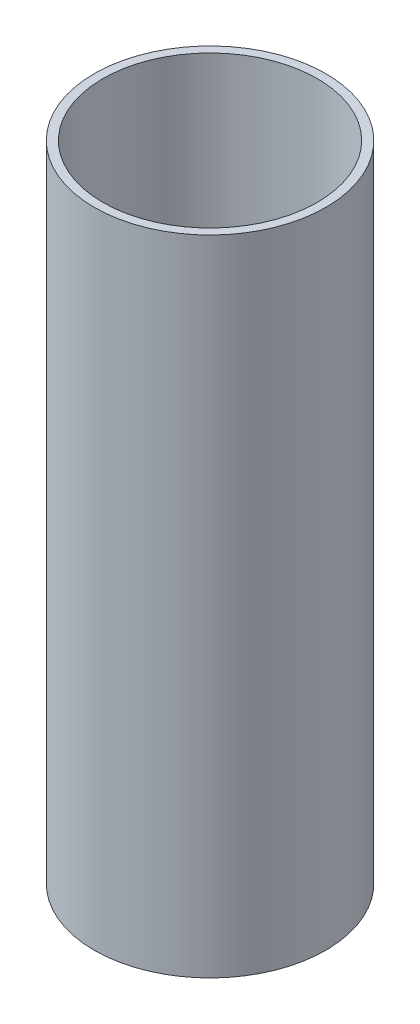
ISO-10303-21;
HEADER;
FILE_DESCRIPTION(('STEP AP214'),'2;1');
FILE_NAME('part.step','',(''),(''),'','','');
FILE_SCHEMA(('AUTOMOTIVE_DESIGN { 1 0 10303 214 1 1 1 1 }'));
ENDSEC;
DATA;
#1=APPLICATION_CONTEXT('core data for automotive mechanical design processes');
#2=APPLICATION_PROTOCOL_DEFINITION('international standard','automotive_design',2000,#1);
#3=PRODUCT_CONTEXT('',#1,'mechanical');
#4=PRODUCT('Part','Part','',(#3));
#5=PRODUCT_RELATED_PRODUCT_CATEGORY('part','',(#4));
#6=PRODUCT_DEFINITION_FORMATION('','',#4);
#7=PRODUCT_DEFINITION_CONTEXT('part definition',#1,'design');
#8=PRODUCT_DEFINITION('design','',#6,#7);
#9=PRODUCT_DEFINITION_SHAPE('','',#8);
#10=(LENGTH_UNIT() NAMED_UNIT(*) SI_UNIT(.MILLI.,.METRE.));
#11=(NAMED_UNIT(*) PLANE_ANGLE_UNIT() SI_UNIT($,.RADIAN.));
#12=(NAMED_UNIT(*) SI_UNIT($,.STERADIAN.) SOLID_ANGLE_UNIT());
#13=UNCERTAINTY_MEASURE_WITH_UNIT(LENGTH_MEASURE(1.E-05),#10,'distance_accuracy_value','');
#14=(GEOMETRIC_REPRESENTATION_CONTEXT(3) GLOBAL_UNCERTAINTY_ASSIGNED_CONTEXT((#13)) GLOBAL_UNIT_ASSIGNED_CONTEXT((#10,
#11,#12)) REPRESENTATION_CONTEXT('',''));
#15=CARTESIAN_POINT('',(0.,0.,0.));
#16=DIRECTION('',(0.,0.,1.));
#17=DIRECTION('',(1.,0.,0.));
#18=AXIS2_PLACEMENT_3D('',#15,#16,#17);
#19=CARTESIAN_POINT('',(0.,150.,0.));
#20=DIRECTION('',(0.,1.,0.));
#21=DIRECTION('',(0.,0.,1.));
#22=AXIS2_PLACEMENT_3D('',#19,#20,#21);
#23=PLANE('',#22);
#24=CARTESIAN_POINT('',(0.,150.,0.));
#25=DIRECTION('',(0.,1.,0.));
#26=DIRECTION('',(0.,0.,1.));
#27=AXIS2_PLACEMENT_3D('',#24,#25,#26);
#28=CIRCLE('',#27,27.);
#29=CARTESIAN_POINT('',(0.,150.,27.));
#30=VERTEX_POINT('',#29);
#31=EDGE_CURVE('E10',#30,#30,#28,.T.);
#32=ORIENTED_EDGE('',*,*,#31,.T.);
#33=EDGE_LOOP('',(#32));
#34=FACE_BOUND('',#33,.T.);
#35=CARTESIAN_POINT('',(0.,150.,0.));
#36=DIRECTION('',(0.,1.,0.));
#37=DIRECTION('',(0.,0.,1.));
#38=AXIS2_PLACEMENT_3D('',#35,#36,#37);
#39=CIRCLE('',#38,25.);
#40=CARTESIAN_POINT('',(0.,150.,25.));
#41=VERTEX_POINT('',#40);
#42=EDGE_CURVE('E48',#41,#41,#39,.T.);
#43=ORIENTED_EDGE('',*,*,#42,.F.);
#44=EDGE_LOOP('',(#43));
#45=FACE_BOUND('',#44,.T.);
#46=ADVANCED_FACE('F37',(#34,#45),#23,.T.);
#47=CARTESIAN_POINT('',(0.,0.,0.));
#48=DIRECTION('',(0.,1.,0.));
#49=DIRECTION('',(0.,0.,1.));
#50=AXIS2_PLACEMENT_3D('',#47,#48,#49);
#51=PLANE('',#50);
#52=CARTESIAN_POINT('',(0.,0.,0.));
#53=DIRECTION('',(0.,1.,0.));
#54=DIRECTION('',(0.,0.,1.));
#55=AXIS2_PLACEMENT_3D('',#52,#53,#54);
#56=CIRCLE('',#55,27.);
#57=CARTESIAN_POINT('',(0.,0.,27.));
#58=VERTEX_POINT('',#57);
#59=EDGE_CURVE('E41',#58,#58,#56,.T.);
#60=ORIENTED_EDGE('',*,*,#59,.F.);
#61=EDGE_LOOP('',(#60));
#62=FACE_BOUND('',#61,.T.);
#63=CARTESIAN_POINT('',(0.,0.,0.));
#64=DIRECTION('',(0.,1.,0.));
#65=DIRECTION('',(0.,0.,1.));
#66=AXIS2_PLACEMENT_3D('',#63,#64,#65);
#67=CIRCLE('',#66,25.);
#68=CARTESIAN_POINT('',(0.,0.,25.));
#69=VERTEX_POINT('',#68);
#70=EDGE_CURVE('E50',#69,#69,#67,.T.);
#71=ORIENTED_EDGE('',*,*,#70,.T.);
#72=EDGE_LOOP('',(#71));
#73=FACE_BOUND('',#72,.T.);
#74=ADVANCED_FACE('F60',(#62,#73),#51,.F.);
#75=CARTESIAN_POINT('',(0.,150.,0.));
#76=DIRECTION('',(0.,-1.,0.));
#77=DIRECTION('',(0.,0.,-1.));
#78=AXIS2_PLACEMENT_3D('',#75,#76,#77);
#79=CYLINDRICAL_SURFACE('',#78,27.);
#80=ORIENTED_EDGE('',*,*,#31,.F.);
#81=EDGE_LOOP('',(#80));
#82=FACE_BOUND('',#81,.T.);
#83=ORIENTED_EDGE('',*,*,#59,.T.);
#84=EDGE_LOOP('',(#83));
#85=FACE_BOUND('',#84,.T.);
#86=ADVANCED_FACE('F39',(#82,#85),#79,.T.);
#87=CARTESIAN_POINT('',(0.,150.,0.));
#88=DIRECTION('',(0.,-1.,0.));
#89=DIRECTION('',(0.,0.,-1.));
#90=AXIS2_PLACEMENT_3D('',#87,#88,#89);
#91=CYLINDRICAL_SURFACE('',#90,25.);
#92=ORIENTED_EDGE('',*,*,#42,.T.);
#93=EDGE_LOOP('',(#92));
#94=FACE_BOUND('',#93,.T.);
#95=ORIENTED_EDGE('',*,*,#70,.F.);
#96=EDGE_LOOP('',(#95));
#97=FACE_BOUND('',#96,.T.);
#98=ADVANCED_FACE('F56',(#94,#97),#91,.F.);
#99=CLOSED_SHELL('',(#46,#74,#86,#98));
#100=MANIFOLD_SOLID_BREP('B2',#99);
#101=ADVANCED_BREP_SHAPE_REPRESENTATION('',(#18,#100),#14);
#102=SHAPE_DEFINITION_REPRESENTATION(#9,#101);
ENDSEC;
END-ISO-10303-21;
